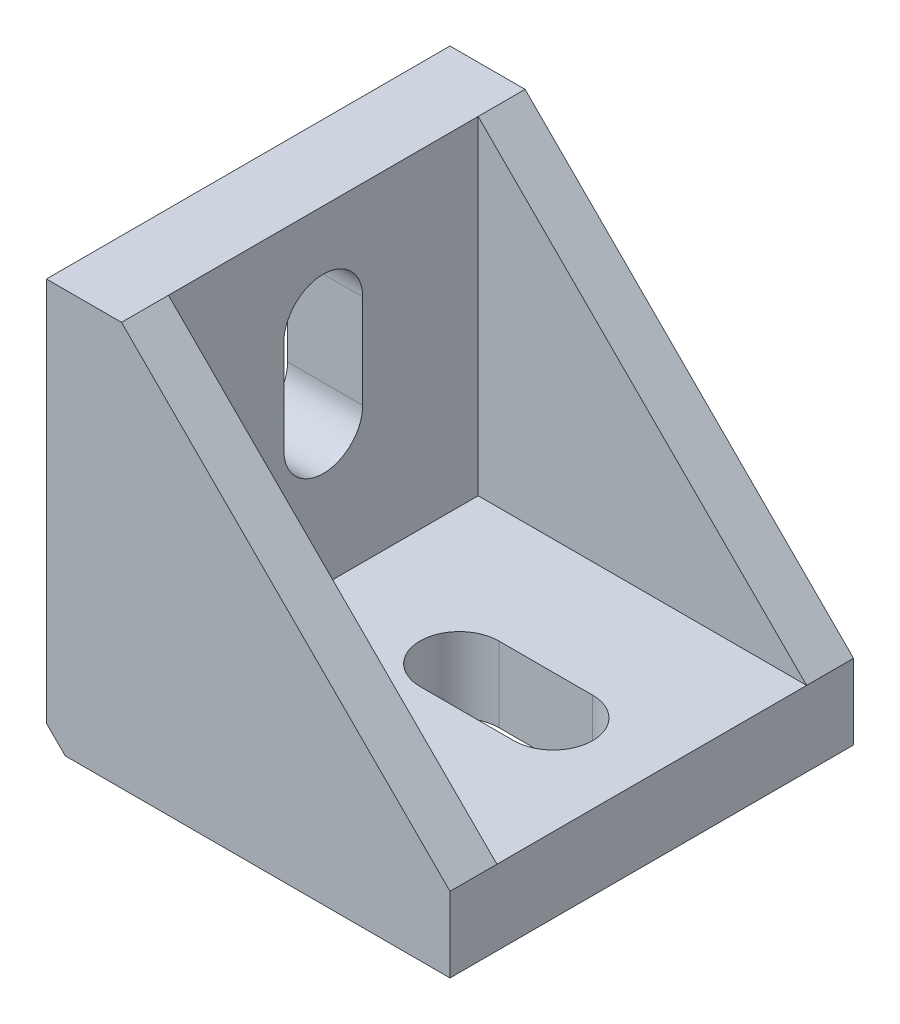
ISO-10303-21;
HEADER;
FILE_DESCRIPTION(('STEP AP214'),'2;1');
FILE_NAME('part.step','',(''),(''),'','','');
FILE_SCHEMA(('AUTOMOTIVE_DESIGN { 1 0 10303 214 1 1 1 1 }'));
ENDSEC;
DATA;
#1=APPLICATION_CONTEXT('core data for automotive mechanical design processes');
#2=APPLICATION_PROTOCOL_DEFINITION('international standard','automotive_design',2000,#1);
#3=PRODUCT_CONTEXT('',#1,'mechanical');
#4=PRODUCT('Part','Part','',(#3));
#5=PRODUCT_RELATED_PRODUCT_CATEGORY('part','',(#4));
#6=PRODUCT_DEFINITION_FORMATION('','',#4);
#7=PRODUCT_DEFINITION_CONTEXT('part definition',#1,'design');
#8=PRODUCT_DEFINITION('design','',#6,#7);
#9=PRODUCT_DEFINITION_SHAPE('','',#8);
#10=(LENGTH_UNIT() NAMED_UNIT(*) SI_UNIT(.MILLI.,.METRE.));
#11=(NAMED_UNIT(*) PLANE_ANGLE_UNIT() SI_UNIT($,.RADIAN.));
#12=(NAMED_UNIT(*) SI_UNIT($,.STERADIAN.) SOLID_ANGLE_UNIT());
#13=UNCERTAINTY_MEASURE_WITH_UNIT(LENGTH_MEASURE(1.E-05),#10,'distance_accuracy_value','');
#14=(GEOMETRIC_REPRESENTATION_CONTEXT(3) GLOBAL_UNCERTAINTY_ASSIGNED_CONTEXT((#13)) GLOBAL_UNIT_ASSIGNED_CONTEXT((#10,
#11,#12)) REPRESENTATION_CONTEXT('',''));
#15=CARTESIAN_POINT('',(0.,0.,0.));
#16=DIRECTION('',(0.,0.,1.));
#17=DIRECTION('',(1.,0.,0.));
#18=AXIS2_PLACEMENT_3D('',#15,#16,#17);
#19=CARTESIAN_POINT('',(0.,43.,43.));
#20=DIRECTION('',(1.,0.,0.));
#21=DIRECTION('',(0.,0.,-1.));
#22=AXIS2_PLACEMENT_3D('',#19,#20,#21);
#23=PLANE('',#22);
#24=DIRECTION('',(0.,-1.,0.));
#25=VECTOR('',#24,1.);
#26=CARTESIAN_POINT('',(0.,43.,0.));
#27=LINE('',#26,#25);
#28=CARTESIAN_POINT('',(0.,43.,0.));
#29=VERTEX_POINT('',#28);
#30=CARTESIAN_POINT('',(0.,2.,0.));
#31=VERTEX_POINT('',#30);
#32=EDGE_CURVE('E244',#29,#31,#27,.T.);
#33=ORIENTED_EDGE('',*,*,#32,.T.);
#34=DIRECTION('',(0.,0.,1.));
#35=VECTOR('',#34,1.);
#36=CARTESIAN_POINT('',(0.,2.,43.));
#37=LINE('',#36,#35);
#38=CARTESIAN_POINT('',(0.,2.,43.));
#39=VERTEX_POINT('',#38);
#40=EDGE_CURVE('E42',#31,#39,#37,.T.);
#41=ORIENTED_EDGE('',*,*,#40,.T.);
#42=DIRECTION('',(0.,-1.,0.));
#43=VECTOR('',#42,1.);
#44=CARTESIAN_POINT('',(0.,43.,43.));
#45=LINE('',#44,#43);
#46=CARTESIAN_POINT('',(0.,43.,43.));
#47=VERTEX_POINT('',#46);
#48=EDGE_CURVE('E232',#47,#39,#45,.T.);
#49=ORIENTED_EDGE('',*,*,#48,.F.);
#50=DIRECTION('',(0.,0.,-1.));
#51=VECTOR('',#50,1.);
#52=CARTESIAN_POINT('',(0.,43.,43.));
#53=LINE('',#52,#51);
#54=EDGE_CURVE('E265',#47,#29,#53,.T.);
#55=ORIENTED_EDGE('',*,*,#54,.T.);
#56=EDGE_LOOP('',(#33,#41,#49,#55));
#57=FACE_BOUND('',#56,.T.);
#58=CARTESIAN_POINT('',(0.,22.5,21.5));
#59=DIRECTION('',(1.,0.,0.));
#60=DIRECTION('',(0.,1.,0.));
#61=AXIS2_PLACEMENT_3D('',#58,#59,#60);
#62=CIRCLE('',#61,4.2);
#63=CARTESIAN_POINT('',(0.,22.5,25.7));
#64=VERTEX_POINT('',#63);
#65=CARTESIAN_POINT('',(0.,22.5,17.3));
#66=VERTEX_POINT('',#65);
#67=EDGE_CURVE('E191',#64,#66,#62,.T.);
#68=ORIENTED_EDGE('',*,*,#67,.T.);
#69=DIRECTION('',(0.,1.,0.));
#70=VECTOR('',#69,1.);
#71=CARTESIAN_POINT('',(0.,22.5,17.3));
#72=LINE('',#71,#70);
#73=CARTESIAN_POINT('',(0.,32.5,17.3));
#74=VERTEX_POINT('',#73);
#75=EDGE_CURVE('E197',#66,#74,#72,.T.);
#76=ORIENTED_EDGE('',*,*,#75,.T.);
#77=CARTESIAN_POINT('',(0.,32.5,21.5));
#78=DIRECTION('',(1.,0.,0.));
#79=DIRECTION('',(0.,1.,0.));
#80=AXIS2_PLACEMENT_3D('',#77,#78,#79);
#81=CIRCLE('',#80,4.2);
#82=CARTESIAN_POINT('',(0.,32.5,25.7));
#83=VERTEX_POINT('',#82);
#84=EDGE_CURVE('E200',#74,#83,#81,.T.);
#85=ORIENTED_EDGE('',*,*,#84,.T.);
#86=DIRECTION('',(0.,-1.,0.));
#87=VECTOR('',#86,1.);
#88=CARTESIAN_POINT('',(0.,22.5,25.7));
#89=LINE('',#88,#87);
#90=EDGE_CURVE('E203',#83,#64,#89,.T.);
#91=ORIENTED_EDGE('',*,*,#90,.T.);
#92=EDGE_LOOP('',(#68,#76,#85,#91));
#93=FACE_BOUND('',#92,.T.);
#94=ADVANCED_FACE('F34',(#57,#93),#23,.F.);
#95=CARTESIAN_POINT('',(8.,43.5587514450867,5.));
#96=DIRECTION('',(-1.,0.,0.));
#97=DIRECTION('',(0.,-1.,0.));
#98=AXIS2_PLACEMENT_3D('',#95,#96,#97);
#99=PLANE('',#98);
#100=DIRECTION('',(0.,-1.,0.));
#101=VECTOR('',#100,1.);
#102=CARTESIAN_POINT('',(8.,43.5587514450867,38.));
#103=LINE('',#102,#101);
#104=CARTESIAN_POINT('',(8.,43.,38.));
#105=VERTEX_POINT('',#104);
#106=CARTESIAN_POINT('',(8.,8.,38.));
#107=VERTEX_POINT('',#106);
#108=EDGE_CURVE('E215',#105,#107,#103,.T.);
#109=ORIENTED_EDGE('',*,*,#108,.T.);
#110=DIRECTION('',(0.,0.,1.));
#111=VECTOR('',#110,1.);
#112=CARTESIAN_POINT('',(8.,8.,5.));
#113=LINE('',#112,#111);
#114=CARTESIAN_POINT('',(8.,8.,5.));
#115=VERTEX_POINT('',#114);
#116=EDGE_CURVE('E222',#115,#107,#113,.T.);
#117=ORIENTED_EDGE('',*,*,#116,.F.);
#118=DIRECTION('',(0.,-1.,0.));
#119=VECTOR('',#118,1.);
#120=CARTESIAN_POINT('',(8.,43.5587514450867,5.));
#121=LINE('',#120,#119);
#122=CARTESIAN_POINT('',(7.99999999999999,43.,5.));
#123=VERTEX_POINT('',#122);
#124=EDGE_CURVE('E216',#123,#115,#121,.T.);
#125=ORIENTED_EDGE('',*,*,#124,.F.);
#126=DIRECTION('',(0.,0.,-1.));
#127=VECTOR('',#126,1.);
#128=CARTESIAN_POINT('',(8.,43.,43.));
#129=LINE('',#128,#127);
#130=EDGE_CURVE('E257',#105,#123,#129,.T.);
#131=ORIENTED_EDGE('',*,*,#130,.F.);
#132=EDGE_LOOP('',(#109,#117,#125,#131));
#133=FACE_BOUND('',#132,.T.);
#134=CARTESIAN_POINT('',(8.,22.5,21.5));
#135=DIRECTION('',(-1.,0.,0.));
#136=DIRECTION('',(0.,-1.,0.));
#137=AXIS2_PLACEMENT_3D('',#134,#135,#136);
#138=CIRCLE('',#137,4.2);
#139=CARTESIAN_POINT('',(8.,22.5,25.7));
#140=VERTEX_POINT('',#139);
#141=CARTESIAN_POINT('',(8.,22.5,17.3));
#142=VERTEX_POINT('',#141);
#143=EDGE_CURVE('E280',#140,#142,#138,.F.);
#144=ORIENTED_EDGE('',*,*,#143,.F.);
#145=DIRECTION('',(0.,-1.,0.));
#146=VECTOR('',#145,1.);
#147=CARTESIAN_POINT('',(8.,43.5587514450867,25.7));
#148=LINE('',#147,#146);
#149=CARTESIAN_POINT('',(8.,32.5,25.7));
#150=VERTEX_POINT('',#149);
#151=EDGE_CURVE('E273',#150,#140,#148,.T.);
#152=ORIENTED_EDGE('',*,*,#151,.F.);
#153=CARTESIAN_POINT('',(8.,32.5,21.5));
#154=DIRECTION('',(-1.,0.,0.));
#155=DIRECTION('',(0.,-1.,0.));
#156=AXIS2_PLACEMENT_3D('',#153,#154,#155);
#157=CIRCLE('',#156,4.2);
#158=CARTESIAN_POINT('',(8.,32.5,17.3));
#159=VERTEX_POINT('',#158);
#160=EDGE_CURVE('E275',#159,#150,#157,.F.);
#161=ORIENTED_EDGE('',*,*,#160,.F.);
#162=DIRECTION('',(0.,1.,0.));
#163=VECTOR('',#162,1.);
#164=CARTESIAN_POINT('',(8.,43.5587514450867,17.3));
#165=LINE('',#164,#163);
#166=EDGE_CURVE('E278',#142,#159,#165,.T.);
#167=ORIENTED_EDGE('',*,*,#166,.F.);
#168=EDGE_LOOP('',(#144,#152,#161,#167));
#169=FACE_BOUND('',#168,.T.);
#170=ADVANCED_FACE('F311',(#133,#169),#99,.F.);
#171=CARTESIAN_POINT('',(43.,8.,43.));
#172=DIRECTION('',(-0.707106781186547,-0.707106781186548,0.));
#173=DIRECTION('',(0.707106781186548,-0.707106781186547,0.));
#174=AXIS2_PLACEMENT_3D('',#171,#172,#173);
#175=PLANE('',#174);
#176=DIRECTION('',(0.707106781186548,-0.707106781186547,0.));
#177=VECTOR('',#176,1.);
#178=CARTESIAN_POINT('',(43.,8.,38.));
#179=LINE('',#178,#177);
#180=CARTESIAN_POINT('',(43.,8.,38.));
#181=VERTEX_POINT('',#180);
#182=EDGE_CURVE('E268',#105,#181,#179,.T.);
#183=ORIENTED_EDGE('',*,*,#182,.F.);
#184=CARTESIAN_POINT('',(8.,43.,43.));
#185=VERTEX_POINT('',#184);
#186=EDGE_CURVE('E253',#185,#105,#129,.T.);
#187=ORIENTED_EDGE('',*,*,#186,.F.);
#188=DIRECTION('',(-0.707106781186548,0.707106781186547,0.));
#189=VECTOR('',#188,1.);
#190=CARTESIAN_POINT('',(43.,8.,43.));
#191=LINE('',#190,#189);
#192=CARTESIAN_POINT('',(43.,8.,43.));
#193=VERTEX_POINT('',#192);
#194=EDGE_CURVE('E239',#193,#185,#191,.T.);
#195=ORIENTED_EDGE('',*,*,#194,.F.);
#196=DIRECTION('',(0.,0.,-1.));
#197=VECTOR('',#196,1.);
#198=CARTESIAN_POINT('',(43.,8.,43.));
#199=LINE('',#198,#197);
#200=EDGE_CURVE('E258',#193,#181,#199,.T.);
#201=ORIENTED_EDGE('',*,*,#200,.T.);
#202=EDGE_LOOP('',(#183,#187,#195,#201));
#203=FACE_BOUND('',#202,.T.);
#204=ADVANCED_FACE('F316',(#203),#175,.F.);
#205=CARTESIAN_POINT('',(8.,43.,43.));
#206=DIRECTION('',(0.,-1.,0.));
#207=DIRECTION('',(0.,0.,-1.));
#208=AXIS2_PLACEMENT_3D('',#205,#206,#207);
#209=PLANE('',#208);
#210=DIRECTION('',(-1.,0.,0.));
#211=VECTOR('',#210,1.);
#212=CARTESIAN_POINT('',(8.,43.,0.));
#213=LINE('',#212,#211);
#214=CARTESIAN_POINT('',(8.,43.,0.));
#215=VERTEX_POINT('',#214);
#216=EDGE_CURVE('E228',#215,#29,#213,.T.);
#217=ORIENTED_EDGE('',*,*,#216,.T.);
#218=ORIENTED_EDGE('',*,*,#54,.F.);
#219=DIRECTION('',(-1.,0.,0.));
#220=VECTOR('',#219,1.);
#221=CARTESIAN_POINT('',(8.,43.,43.));
#222=LINE('',#221,#220);
#223=EDGE_CURVE('E229',#185,#47,#222,.T.);
#224=ORIENTED_EDGE('',*,*,#223,.F.);
#225=ORIENTED_EDGE('',*,*,#186,.T.);
#226=ORIENTED_EDGE('',*,*,#130,.T.);
#227=EDGE_CURVE('E241',#123,#215,#129,.T.);
#228=ORIENTED_EDGE('',*,*,#227,.T.);
#229=EDGE_LOOP('',(#217,#218,#224,#225,#226,#228));
#230=FACE_BOUND('',#229,.T.);
#231=ADVANCED_FACE('F322',(#230),#209,.F.);
#232=CARTESIAN_POINT('',(0.,0.,43.));
#233=DIRECTION('',(0.,1.,0.));
#234=DIRECTION('',(0.,0.,1.));
#235=AXIS2_PLACEMENT_3D('',#232,#233,#234);
#236=PLANE('',#235);
#237=DIRECTION('',(1.,0.,0.));
#238=VECTOR('',#237,1.);
#239=CARTESIAN_POINT('',(32.5,0.,25.7));
#240=LINE('',#239,#238);
#241=CARTESIAN_POINT('',(22.5,0.,25.7));
#242=VERTEX_POINT('',#241);
#243=CARTESIAN_POINT('',(32.5,0.,25.7));
#244=VERTEX_POINT('',#243);
#245=EDGE_CURVE('E163',#242,#244,#240,.T.);
#246=ORIENTED_EDGE('',*,*,#245,.T.);
#247=CARTESIAN_POINT('',(32.5,0.,21.5));
#248=DIRECTION('',(0.,1.,0.));
#249=DIRECTION('',(0.,0.,1.));
#250=AXIS2_PLACEMENT_3D('',#247,#248,#249);
#251=CIRCLE('',#250,4.19999999999999);
#252=CARTESIAN_POINT('',(32.5,0.,17.3));
#253=VERTEX_POINT('',#252);
#254=EDGE_CURVE('E155',#244,#253,#251,.T.);
#255=ORIENTED_EDGE('',*,*,#254,.T.);
#256=DIRECTION('',(-1.,0.,0.));
#257=VECTOR('',#256,1.);
#258=CARTESIAN_POINT('',(32.5,0.,17.3));
#259=LINE('',#258,#257);
#260=CARTESIAN_POINT('',(22.5,0.,17.3));
#261=VERTEX_POINT('',#260);
#262=EDGE_CURVE('E167',#253,#261,#259,.T.);
#263=ORIENTED_EDGE('',*,*,#262,.T.);
#264=CARTESIAN_POINT('',(22.5,0.,21.5));
#265=DIRECTION('',(0.,1.,0.));
#266=DIRECTION('',(0.,0.,1.));
#267=AXIS2_PLACEMENT_3D('',#264,#265,#266);
#268=CIRCLE('',#267,4.19999999999999);
#269=EDGE_CURVE('E171',#261,#242,#268,.T.);
#270=ORIENTED_EDGE('',*,*,#269,.T.);
#271=EDGE_LOOP('',(#246,#255,#263,#270));
#272=FACE_BOUND('',#271,.T.);
#273=DIRECTION('',(1.,0.,0.));
#274=VECTOR('',#273,1.);
#275=CARTESIAN_POINT('',(0.,0.,43.));
#276=LINE('',#275,#274);
#277=CARTESIAN_POINT('',(1.99999999999999,0.,43.));
#278=VERTEX_POINT('',#277);
#279=CARTESIAN_POINT('',(43.,0.,43.));
#280=VERTEX_POINT('',#279);
#281=EDGE_CURVE('E235',#278,#280,#276,.T.);
#282=ORIENTED_EDGE('',*,*,#281,.F.);
#283=DIRECTION('',(0.,0.,-1.));
#284=VECTOR('',#283,1.);
#285=CARTESIAN_POINT('',(1.99999999999999,0.,43.));
#286=LINE('',#285,#284);
#287=CARTESIAN_POINT('',(1.99999999999999,0.,0.));
#288=VERTEX_POINT('',#287);
#289=EDGE_CURVE('E282',#278,#288,#286,.T.);
#290=ORIENTED_EDGE('',*,*,#289,.T.);
#291=DIRECTION('',(1.,0.,0.));
#292=VECTOR('',#291,1.);
#293=CARTESIAN_POINT('',(0.,0.,0.));
#294=LINE('',#293,#292);
#295=CARTESIAN_POINT('',(43.,0.,0.));
#296=VERTEX_POINT('',#295);
#297=EDGE_CURVE('E246',#288,#296,#294,.T.);
#298=ORIENTED_EDGE('',*,*,#297,.T.);
#299=DIRECTION('',(0.,0.,-1.));
#300=VECTOR('',#299,1.);
#301=CARTESIAN_POINT('',(43.,0.,43.));
#302=LINE('',#301,#300);
#303=EDGE_CURVE('E261',#280,#296,#302,.T.);
#304=ORIENTED_EDGE('',*,*,#303,.F.);
#305=EDGE_LOOP('',(#282,#290,#298,#304));
#306=FACE_BOUND('',#305,.T.);
#307=ADVANCED_FACE('F173',(#272,#306),#236,.F.);
#308=CARTESIAN_POINT('',(43.,0.,43.));
#309=DIRECTION('',(-1.,0.,0.));
#310=DIRECTION('',(0.,0.,1.));
#311=AXIS2_PLACEMENT_3D('',#308,#309,#310);
#312=PLANE('',#311);
#313=DIRECTION('',(0.,1.,0.));
#314=VECTOR('',#313,1.);
#315=CARTESIAN_POINT('',(43.,0.,0.));
#316=LINE('',#315,#314);
#317=CARTESIAN_POINT('',(43.,8.,0.));
#318=VERTEX_POINT('',#317);
#319=EDGE_CURVE('E248',#296,#318,#316,.T.);
#320=ORIENTED_EDGE('',*,*,#319,.T.);
#321=CARTESIAN_POINT('',(43.,8.,5.));
#322=VERTEX_POINT('',#321);
#323=EDGE_CURVE('E256',#322,#318,#199,.T.);
#324=ORIENTED_EDGE('',*,*,#323,.F.);
#325=EDGE_CURVE('E262',#181,#322,#199,.T.);
#326=ORIENTED_EDGE('',*,*,#325,.F.);
#327=ORIENTED_EDGE('',*,*,#200,.F.);
#328=DIRECTION('',(0.,1.,0.));
#329=VECTOR('',#328,1.);
#330=CARTESIAN_POINT('',(43.,0.,43.));
#331=LINE('',#330,#329);
#332=EDGE_CURVE('E237',#280,#193,#331,.T.);
#333=ORIENTED_EDGE('',*,*,#332,.F.);
#334=ORIENTED_EDGE('',*,*,#303,.T.);
#335=EDGE_LOOP('',(#320,#324,#326,#327,#333,#334));
#336=FACE_BOUND('',#335,.T.);
#337=ADVANCED_FACE('F296',(#336),#312,.F.);
#338=ORIENTED_EDGE('',*,*,#227,.F.);
#339=DIRECTION('',(0.707106781186548,-0.707106781186547,0.));
#340=VECTOR('',#339,1.);
#341=CARTESIAN_POINT('',(43.,8.,5.));
#342=LINE('',#341,#340);
#343=EDGE_CURVE('E270',#123,#322,#342,.T.);
#344=ORIENTED_EDGE('',*,*,#343,.T.);
#345=ORIENTED_EDGE('',*,*,#323,.T.);
#346=DIRECTION('',(-0.707106781186548,0.707106781186547,0.));
#347=VECTOR('',#346,1.);
#348=CARTESIAN_POINT('',(43.,8.,0.));
#349=LINE('',#348,#347);
#350=EDGE_CURVE('E233',#318,#215,#349,.T.);
#351=ORIENTED_EDGE('',*,*,#350,.T.);
#352=EDGE_LOOP('',(#338,#344,#345,#351));
#353=FACE_BOUND('',#352,.T.);
#354=ADVANCED_FACE('F331',(#353),#175,.F.);
#355=CARTESIAN_POINT('',(0.,0.,43.));
#356=DIRECTION('',(0.,0.,1.));
#357=DIRECTION('',(1.,0.,0.));
#358=AXIS2_PLACEMENT_3D('',#355,#356,#357);
#359=PLANE('',#358);
#360=ORIENTED_EDGE('',*,*,#48,.T.);
#361=DIRECTION('',(-0.707106781186546,0.707106781186549,0.));
#362=VECTOR('',#361,1.);
#363=CARTESIAN_POINT('',(1.,0.999999999999997,43.));
#364=LINE('',#363,#362);
#365=EDGE_CURVE('E11',#39,#278,#364,.F.);
#366=ORIENTED_EDGE('',*,*,#365,.T.);
#367=ORIENTED_EDGE('',*,*,#281,.T.);
#368=ORIENTED_EDGE('',*,*,#332,.T.);
#369=ORIENTED_EDGE('',*,*,#194,.T.);
#370=ORIENTED_EDGE('',*,*,#223,.T.);
#371=EDGE_LOOP('',(#360,#366,#367,#368,#369,#370));
#372=FACE_BOUND('',#371,.T.);
#373=ADVANCED_FACE('F302',(#372),#359,.T.);
#374=CARTESIAN_POINT('',(0.,0.,0.));
#375=DIRECTION('',(0.,0.,1.));
#376=DIRECTION('',(1.,0.,0.));
#377=AXIS2_PLACEMENT_3D('',#374,#375,#376);
#378=PLANE('',#377);
#379=ORIENTED_EDGE('',*,*,#297,.F.);
#380=DIRECTION('',(0.707106781186546,-0.707106781186549,0.));
#381=VECTOR('',#380,1.);
#382=CARTESIAN_POINT('',(1.99999999999999,0.,0.));
#383=LINE('',#382,#381);
#384=EDGE_CURVE('E56',#288,#31,#383,.F.);
#385=ORIENTED_EDGE('',*,*,#384,.T.);
#386=ORIENTED_EDGE('',*,*,#32,.F.);
#387=ORIENTED_EDGE('',*,*,#216,.F.);
#388=ORIENTED_EDGE('',*,*,#350,.F.);
#389=ORIENTED_EDGE('',*,*,#319,.F.);
#390=EDGE_LOOP('',(#379,#385,#386,#387,#388,#389));
#391=FACE_BOUND('',#390,.T.);
#392=ADVANCED_FACE('F291',(#391),#378,.F.);
#393=CARTESIAN_POINT('',(8.,8.,5.));
#394=DIRECTION('',(0.,-1.,0.));
#395=DIRECTION('',(0.,0.,-1.));
#396=AXIS2_PLACEMENT_3D('',#393,#394,#395);
#397=PLANE('',#396);
#398=DIRECTION('',(-1.,0.,0.));
#399=VECTOR('',#398,1.);
#400=CARTESIAN_POINT('',(32.5,8.,17.3));
#401=LINE('',#400,#399);
#402=CARTESIAN_POINT('',(32.5,8.,17.3));
#403=VERTEX_POINT('',#402);
#404=CARTESIAN_POINT('',(22.5,8.,17.3));
#405=VERTEX_POINT('',#404);
#406=EDGE_CURVE('E185',#403,#405,#401,.T.);
#407=ORIENTED_EDGE('',*,*,#406,.F.);
#408=CARTESIAN_POINT('',(32.5,8.,21.5));
#409=DIRECTION('',(0.,1.,0.));
#410=DIRECTION('',(0.,0.,1.));
#411=AXIS2_PLACEMENT_3D('',#408,#409,#410);
#412=CIRCLE('',#411,4.19999999999999);
#413=CARTESIAN_POINT('',(32.5,8.,25.7));
#414=VERTEX_POINT('',#413);
#415=EDGE_CURVE('E158',#414,#403,#412,.T.);
#416=ORIENTED_EDGE('',*,*,#415,.F.);
#417=DIRECTION('',(1.,0.,0.));
#418=VECTOR('',#417,1.);
#419=CARTESIAN_POINT('',(32.5,8.,25.7));
#420=LINE('',#419,#418);
#421=CARTESIAN_POINT('',(22.5,8.,25.7));
#422=VERTEX_POINT('',#421);
#423=EDGE_CURVE('E176',#422,#414,#420,.T.);
#424=ORIENTED_EDGE('',*,*,#423,.F.);
#425=CARTESIAN_POINT('',(22.5,8.,21.5));
#426=DIRECTION('',(0.,1.,0.));
#427=DIRECTION('',(0.,0.,1.));
#428=AXIS2_PLACEMENT_3D('',#425,#426,#427);
#429=CIRCLE('',#428,4.19999999999999);
#430=EDGE_CURVE('E179',#405,#422,#429,.T.);
#431=ORIENTED_EDGE('',*,*,#430,.F.);
#432=EDGE_LOOP('',(#407,#416,#424,#431));
#433=FACE_BOUND('',#432,.T.);
#434=DIRECTION('',(1.,0.,0.));
#435=VECTOR('',#434,1.);
#436=CARTESIAN_POINT('',(8.,8.,5.));
#437=LINE('',#436,#435);
#438=EDGE_CURVE('E218',#115,#322,#437,.T.);
#439=ORIENTED_EDGE('',*,*,#438,.F.);
#440=ORIENTED_EDGE('',*,*,#116,.T.);
#441=DIRECTION('',(1.,0.,0.));
#442=VECTOR('',#441,1.);
#443=CARTESIAN_POINT('',(8.,8.,38.));
#444=LINE('',#443,#442);
#445=EDGE_CURVE('E219',#107,#181,#444,.T.);
#446=ORIENTED_EDGE('',*,*,#445,.T.);
#447=ORIENTED_EDGE('',*,*,#325,.T.);
#448=EDGE_LOOP('',(#439,#440,#446,#447));
#449=FACE_BOUND('',#448,.T.);
#450=ADVANCED_FACE('F343',(#433,#449),#397,.F.);
#451=CARTESIAN_POINT('',(0.,0.,5.));
#452=DIRECTION('',(0.,0.,-1.));
#453=DIRECTION('',(-1.,0.,0.));
#454=AXIS2_PLACEMENT_3D('',#451,#452,#453);
#455=PLANE('',#454);
#456=ORIENTED_EDGE('',*,*,#124,.T.);
#457=ORIENTED_EDGE('',*,*,#438,.T.);
#458=ORIENTED_EDGE('',*,*,#343,.F.);
#459=EDGE_LOOP('',(#456,#457,#458));
#460=FACE_BOUND('',#459,.T.);
#461=ADVANCED_FACE('F348',(#460),#455,.F.);
#462=CARTESIAN_POINT('',(0.,0.,38.));
#463=DIRECTION('',(0.,0.,-1.));
#464=DIRECTION('',(-1.,0.,0.));
#465=AXIS2_PLACEMENT_3D('',#462,#463,#464);
#466=PLANE('',#465);
#467=ORIENTED_EDGE('',*,*,#182,.T.);
#468=ORIENTED_EDGE('',*,*,#445,.F.);
#469=ORIENTED_EDGE('',*,*,#108,.F.);
#470=EDGE_LOOP('',(#467,#468,#469));
#471=FACE_BOUND('',#470,.T.);
#472=ADVANCED_FACE('F340',(#471),#466,.T.);
#473=CARTESIAN_POINT('',(43.,22.5,21.5));
#474=DIRECTION('',(-1.,0.,0.));
#475=DIRECTION('',(0.,-1.,0.));
#476=AXIS2_PLACEMENT_3D('',#473,#474,#475);
#477=CYLINDRICAL_SURFACE('',#476,4.2);
#478=ORIENTED_EDGE('',*,*,#143,.T.);
#479=DIRECTION('',(-1.,0.,0.));
#480=VECTOR('',#479,1.);
#481=CARTESIAN_POINT('',(43.,22.5,17.3));
#482=LINE('',#481,#480);
#483=EDGE_CURVE('E213',#142,#66,#482,.T.);
#484=ORIENTED_EDGE('',*,*,#483,.T.);
#485=ORIENTED_EDGE('',*,*,#67,.F.);
#486=DIRECTION('',(-1.,0.,0.));
#487=VECTOR('',#486,1.);
#488=CARTESIAN_POINT('',(43.,22.5,25.7));
#489=LINE('',#488,#487);
#490=EDGE_CURVE('E206',#140,#64,#489,.T.);
#491=ORIENTED_EDGE('',*,*,#490,.F.);
#492=EDGE_LOOP('',(#478,#484,#485,#491));
#493=FACE_BOUND('',#492,.T.);
#494=ADVANCED_FACE('F357',(#493),#477,.F.);
#495=CARTESIAN_POINT('',(43.,22.5,17.3));
#496=DIRECTION('',(0.,0.,1.));
#497=DIRECTION('',(1.,0.,0.));
#498=AXIS2_PLACEMENT_3D('',#495,#496,#497);
#499=PLANE('',#498);
#500=ORIENTED_EDGE('',*,*,#166,.T.);
#501=DIRECTION('',(-1.,0.,0.));
#502=VECTOR('',#501,1.);
#503=CARTESIAN_POINT('',(43.,32.5,17.3));
#504=LINE('',#503,#502);
#505=EDGE_CURVE('E211',#159,#74,#504,.T.);
#506=ORIENTED_EDGE('',*,*,#505,.T.);
#507=ORIENTED_EDGE('',*,*,#75,.F.);
#508=ORIENTED_EDGE('',*,*,#483,.F.);
#509=EDGE_LOOP('',(#500,#506,#507,#508));
#510=FACE_BOUND('',#509,.T.);
#511=ADVANCED_FACE('F360',(#510),#499,.T.);
#512=CARTESIAN_POINT('',(43.,32.5,21.5));
#513=DIRECTION('',(-1.,0.,0.));
#514=DIRECTION('',(0.,-1.,0.));
#515=AXIS2_PLACEMENT_3D('',#512,#513,#514);
#516=CYLINDRICAL_SURFACE('',#515,4.2);
#517=ORIENTED_EDGE('',*,*,#160,.T.);
#518=DIRECTION('',(-1.,0.,0.));
#519=VECTOR('',#518,1.);
#520=CARTESIAN_POINT('',(43.,32.5,25.7));
#521=LINE('',#520,#519);
#522=EDGE_CURVE('E209',#150,#83,#521,.T.);
#523=ORIENTED_EDGE('',*,*,#522,.T.);
#524=ORIENTED_EDGE('',*,*,#84,.F.);
#525=ORIENTED_EDGE('',*,*,#505,.F.);
#526=EDGE_LOOP('',(#517,#523,#524,#525));
#527=FACE_BOUND('',#526,.T.);
#528=ADVANCED_FACE('F367',(#527),#516,.F.);
#529=CARTESIAN_POINT('',(43.,22.5,25.7));
#530=DIRECTION('',(0.,0.,-1.));
#531=DIRECTION('',(-1.,0.,0.));
#532=AXIS2_PLACEMENT_3D('',#529,#530,#531);
#533=PLANE('',#532);
#534=ORIENTED_EDGE('',*,*,#151,.T.);
#535=ORIENTED_EDGE('',*,*,#490,.T.);
#536=ORIENTED_EDGE('',*,*,#90,.F.);
#537=ORIENTED_EDGE('',*,*,#522,.F.);
#538=EDGE_LOOP('',(#534,#535,#536,#537));
#539=FACE_BOUND('',#538,.T.);
#540=ADVANCED_FACE('F365',(#539),#533,.T.);
#541=CARTESIAN_POINT('',(32.5,0.,21.5));
#542=DIRECTION('',(0.,1.,0.));
#543=DIRECTION('',(0.,0.,1.));
#544=AXIS2_PLACEMENT_3D('',#541,#542,#543);
#545=CYLINDRICAL_SURFACE('',#544,4.19999999999999);
#546=ORIENTED_EDGE('',*,*,#415,.T.);
#547=DIRECTION('',(0.,1.,0.));
#548=VECTOR('',#547,1.);
#549=CARTESIAN_POINT('',(32.5,0.,17.3));
#550=LINE('',#549,#548);
#551=EDGE_CURVE('E151',#253,#403,#550,.T.);
#552=ORIENTED_EDGE('',*,*,#551,.F.);
#553=ORIENTED_EDGE('',*,*,#254,.F.);
#554=DIRECTION('',(0.,1.,0.));
#555=VECTOR('',#554,1.);
#556=CARTESIAN_POINT('',(32.5,0.,25.7));
#557=LINE('',#556,#555);
#558=EDGE_CURVE('E189',#244,#414,#557,.T.);
#559=ORIENTED_EDGE('',*,*,#558,.T.);
#560=EDGE_LOOP('',(#546,#552,#553,#559));
#561=FACE_BOUND('',#560,.T.);
#562=ADVANCED_FACE('F153',(#561),#545,.F.);
#563=CARTESIAN_POINT('',(32.5,0.,25.7));
#564=DIRECTION('',(0.,0.,1.));
#565=DIRECTION('',(1.,0.,0.));
#566=AXIS2_PLACEMENT_3D('',#563,#564,#565);
#567=PLANE('',#566);
#568=ORIENTED_EDGE('',*,*,#423,.T.);
#569=ORIENTED_EDGE('',*,*,#558,.F.);
#570=ORIENTED_EDGE('',*,*,#245,.F.);
#571=DIRECTION('',(0.,1.,0.));
#572=VECTOR('',#571,1.);
#573=CARTESIAN_POINT('',(22.5,0.,25.7));
#574=LINE('',#573,#572);
#575=EDGE_CURVE('E192',#242,#422,#574,.T.);
#576=ORIENTED_EDGE('',*,*,#575,.T.);
#577=EDGE_LOOP('',(#568,#569,#570,#576));
#578=FACE_BOUND('',#577,.T.);
#579=ADVANCED_FACE('F448',(#578),#567,.F.);
#580=CARTESIAN_POINT('',(22.5,0.,21.5));
#581=DIRECTION('',(0.,1.,0.));
#582=DIRECTION('',(0.,0.,1.));
#583=AXIS2_PLACEMENT_3D('',#580,#581,#582);
#584=CYLINDRICAL_SURFACE('',#583,4.19999999999999);
#585=ORIENTED_EDGE('',*,*,#430,.T.);
#586=ORIENTED_EDGE('',*,*,#575,.F.);
#587=ORIENTED_EDGE('',*,*,#269,.F.);
#588=DIRECTION('',(0.,1.,0.));
#589=VECTOR('',#588,1.);
#590=CARTESIAN_POINT('',(22.5,0.,17.3));
#591=LINE('',#590,#589);
#592=EDGE_CURVE('E162',#261,#405,#591,.T.);
#593=ORIENTED_EDGE('',*,*,#592,.T.);
#594=EDGE_LOOP('',(#585,#586,#587,#593));
#595=FACE_BOUND('',#594,.T.);
#596=ADVANCED_FACE('F308',(#595),#584,.F.);
#597=CARTESIAN_POINT('',(32.5,0.,17.3));
#598=DIRECTION('',(0.,0.,-1.));
#599=DIRECTION('',(-1.,0.,0.));
#600=AXIS2_PLACEMENT_3D('',#597,#598,#599);
#601=PLANE('',#600);
#602=ORIENTED_EDGE('',*,*,#406,.T.);
#603=ORIENTED_EDGE('',*,*,#592,.F.);
#604=ORIENTED_EDGE('',*,*,#262,.F.);
#605=ORIENTED_EDGE('',*,*,#551,.T.);
#606=EDGE_LOOP('',(#602,#603,#604,#605));
#607=FACE_BOUND('',#606,.T.);
#608=ADVANCED_FACE('F168',(#607),#601,.F.);
#609=CARTESIAN_POINT('',(1.99999999999999,0.,43.));
#610=DIRECTION('',(0.707106781186549,0.707106781186546,0.));
#611=DIRECTION('',(0.,0.,-1.));
#612=AXIS2_PLACEMENT_3D('',#609,#610,#611);
#613=PLANE('',#612);
#614=ORIENTED_EDGE('',*,*,#365,.F.);
#615=ORIENTED_EDGE('',*,*,#40,.F.);
#616=ORIENTED_EDGE('',*,*,#384,.F.);
#617=ORIENTED_EDGE('',*,*,#289,.F.);
#618=EDGE_LOOP('',(#614,#615,#616,#617));
#619=FACE_BOUND('',#618,.T.);
#620=ADVANCED_FACE('F36',(#619),#613,.F.);
#621=CLOSED_SHELL('',(#94,#170,#204,#231,#307,#337,#354,#373,#392,#450,#461,#472,#494,#511,#528,
#540,#562,#579,#596,#608,#620));
#622=MANIFOLD_SOLID_BREP('B2',#621);
#623=ADVANCED_BREP_SHAPE_REPRESENTATION('',(#18,#622),#14);
#624=SHAPE_DEFINITION_REPRESENTATION(#9,#623);
ENDSEC;
END-ISO-10303-21;
